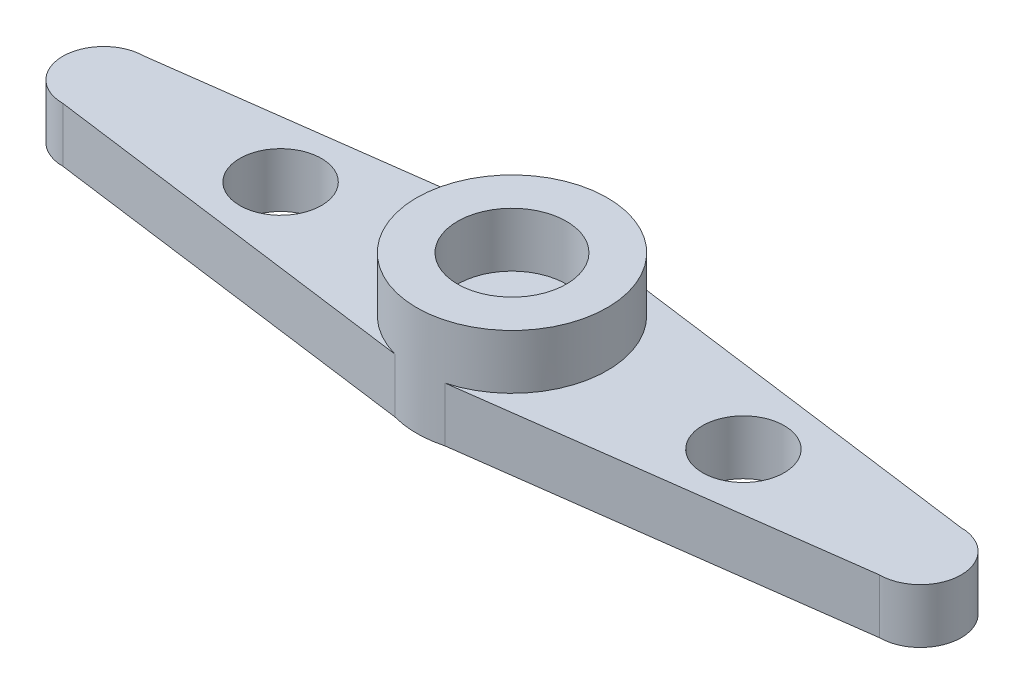
ISO-10303-21;
HEADER;
FILE_DESCRIPTION(('STEP AP214'),'2;1');
FILE_NAME('part.step','',(''),(''),'','','');
FILE_SCHEMA(('AUTOMOTIVE_DESIGN { 1 0 10303 214 1 1 1 1 }'));
ENDSEC;
DATA;
#1=APPLICATION_CONTEXT('core data for automotive mechanical design processes');
#2=APPLICATION_PROTOCOL_DEFINITION('international standard','automotive_design',2000,#1);
#3=PRODUCT_CONTEXT('',#1,'mechanical');
#4=PRODUCT('Part','Part','',(#3));
#5=PRODUCT_RELATED_PRODUCT_CATEGORY('part','',(#4));
#6=PRODUCT_DEFINITION_FORMATION('','',#4);
#7=PRODUCT_DEFINITION_CONTEXT('part definition',#1,'design');
#8=PRODUCT_DEFINITION('design','',#6,#7);
#9=PRODUCT_DEFINITION_SHAPE('','',#8);
#10=(LENGTH_UNIT() NAMED_UNIT(*) SI_UNIT(.MILLI.,.METRE.));
#11=(NAMED_UNIT(*) PLANE_ANGLE_UNIT() SI_UNIT($,.RADIAN.));
#12=(NAMED_UNIT(*) SI_UNIT($,.STERADIAN.) SOLID_ANGLE_UNIT());
#13=UNCERTAINTY_MEASURE_WITH_UNIT(LENGTH_MEASURE(1.E-05),#10,'distance_accuracy_value','');
#14=(GEOMETRIC_REPRESENTATION_CONTEXT(3) GLOBAL_UNCERTAINTY_ASSIGNED_CONTEXT((#13)) GLOBAL_UNIT_ASSIGNED_CONTEXT((#10,
#11,#12)) REPRESENTATION_CONTEXT('',''));
#15=CARTESIAN_POINT('',(0.,0.,0.));
#16=DIRECTION('',(0.,0.,1.));
#17=DIRECTION('',(1.,0.,0.));
#18=AXIS2_PLACEMENT_3D('',#15,#16,#17);
#19=CARTESIAN_POINT('',(0.,4.,0.));
#20=DIRECTION('',(0.,-1.,0.));
#21=DIRECTION('',(0.,0.,-1.));
#22=AXIS2_PLACEMENT_3D('',#19,#20,#21);
#23=CYLINDRICAL_SURFACE('',#22,3.5);
#24=CARTESIAN_POINT('',(0.,0.,0.));
#25=DIRECTION('',(0.,1.,0.));
#26=DIRECTION('',(0.,0.,1.));
#27=AXIS2_PLACEMENT_3D('',#24,#25,#26);
#28=CIRCLE('',#27,3.5);
#29=CARTESIAN_POINT('',(0.917030567685587,0.,-3.37772925764192));
#30=VERTEX_POINT('',#29);
#31=CARTESIAN_POINT('',(-0.917030567685587,0.,-3.37772925764192));
#32=VERTEX_POINT('',#31);
#33=EDGE_CURVE('E169',#30,#32,#28,.T.);
#34=ORIENTED_EDGE('',*,*,#33,.T.);
#35=DIRECTION('',(0.,-1.,0.));
#36=VECTOR('',#35,1.);
#37=CARTESIAN_POINT('',(-0.917030567685585,4.,-3.37772925764192));
#38=LINE('',#37,#36);
#39=CARTESIAN_POINT('',(-0.917030567685598,2.,-3.37772925764192));
#40=VERTEX_POINT('',#39);
#41=EDGE_CURVE('E46',#32,#40,#38,.F.);
#42=ORIENTED_EDGE('',*,*,#41,.T.);
#43=CARTESIAN_POINT('',(0.,2.,0.));
#44=DIRECTION('',(0.,-1.,0.));
#45=DIRECTION('',(0.,0.,-1.));
#46=AXIS2_PLACEMENT_3D('',#43,#44,#45);
#47=CIRCLE('',#46,3.5);
#48=CARTESIAN_POINT('',(-0.917030567685594,2.,3.37772925764192));
#49=VERTEX_POINT('',#48);
#50=EDGE_CURVE('E11',#49,#40,#47,.T.);
#51=ORIENTED_EDGE('',*,*,#50,.F.);
#52=DIRECTION('',(0.,-1.,0.));
#53=VECTOR('',#52,1.);
#54=CARTESIAN_POINT('',(-0.917030567685585,4.,3.37772925764192));
#55=LINE('',#54,#53);
#56=CARTESIAN_POINT('',(-0.917030567685587,0.,3.37772925764192));
#57=VERTEX_POINT('',#56);
#58=EDGE_CURVE('E111',#49,#57,#55,.T.);
#59=ORIENTED_EDGE('',*,*,#58,.T.);
#60=CARTESIAN_POINT('',(0.917030567685585,0.,3.37772925764192));
#61=VERTEX_POINT('',#60);
#62=EDGE_CURVE('E163',#57,#61,#28,.T.);
#63=ORIENTED_EDGE('',*,*,#62,.T.);
#64=DIRECTION('',(0.,-1.,0.));
#65=VECTOR('',#64,1.);
#66=CARTESIAN_POINT('',(0.917030567685585,4.,3.37772925764192));
#67=LINE('',#66,#65);
#68=CARTESIAN_POINT('',(0.917030567685594,2.,3.37772925764192));
#69=VERTEX_POINT('',#68);
#70=EDGE_CURVE('E156',#69,#61,#67,.T.);
#71=ORIENTED_EDGE('',*,*,#70,.F.);
#72=CARTESIAN_POINT('',(0.,2.,0.));
#73=DIRECTION('',(0.,-1.,0.));
#74=DIRECTION('',(0.,0.,-1.));
#75=AXIS2_PLACEMENT_3D('',#72,#73,#74);
#76=CIRCLE('',#75,3.5);
#77=CARTESIAN_POINT('',(0.917030567685598,2.,-3.37772925764192));
#78=VERTEX_POINT('',#77);
#79=EDGE_CURVE('E39',#78,#69,#76,.T.);
#80=ORIENTED_EDGE('',*,*,#79,.F.);
#81=DIRECTION('',(0.,-1.,0.));
#82=VECTOR('',#81,1.);
#83=CARTESIAN_POINT('',(0.917030567685585,4.,-3.37772925764192));
#84=LINE('',#83,#82);
#85=EDGE_CURVE('E153',#30,#78,#84,.F.);
#86=ORIENTED_EDGE('',*,*,#85,.F.);
#87=EDGE_LOOP('',(#34,#42,#51,#59,#63,#71,#80,#86));
#88=FACE_BOUND('',#87,.T.);
#89=CARTESIAN_POINT('',(0.,4.,0.));
#90=DIRECTION('',(0.,1.,0.));
#91=DIRECTION('',(0.,0.,1.));
#92=AXIS2_PLACEMENT_3D('',#89,#90,#91);
#93=CIRCLE('',#92,3.5);
#94=CARTESIAN_POINT('',(0.,4.,3.5));
#95=VERTEX_POINT('',#94);
#96=EDGE_CURVE('E166',#95,#95,#93,.T.);
#97=ORIENTED_EDGE('',*,*,#96,.F.);
#98=EDGE_LOOP('',(#97));
#99=FACE_BOUND('',#98,.T.);
#100=ADVANCED_FACE('F32',(#88,#99),#23,.T.);
#101=CARTESIAN_POINT('',(0.,4.,0.));
#102=DIRECTION('',(0.,1.,0.));
#103=DIRECTION('',(0.,0.,1.));
#104=AXIS2_PLACEMENT_3D('',#101,#102,#103);
#105=PLANE('',#104);
#106=CARTESIAN_POINT('',(0.,4.,0.));
#107=DIRECTION('',(0.,1.,0.));
#108=DIRECTION('',(0.,0.,1.));
#109=AXIS2_PLACEMENT_3D('',#106,#107,#108);
#110=CIRCLE('',#109,2.);
#111=CARTESIAN_POINT('',(0.,4.,2.));
#112=VERTEX_POINT('',#111);
#113=EDGE_CURVE('E159',#112,#112,#110,.T.);
#114=ORIENTED_EDGE('',*,*,#113,.F.);
#115=EDGE_LOOP('',(#114));
#116=FACE_BOUND('',#115,.T.);
#117=ORIENTED_EDGE('',*,*,#96,.T.);
#118=EDGE_LOOP('',(#117));
#119=FACE_BOUND('',#118,.T.);
#120=ADVANCED_FACE('F204',(#116,#119),#105,.T.);
#121=CARTESIAN_POINT('',(0.,0.,0.));
#122=DIRECTION('',(0.,1.,0.));
#123=DIRECTION('',(0.,0.,1.));
#124=AXIS2_PLACEMENT_3D('',#121,#122,#123);
#125=PLANE('',#124);
#126=CARTESIAN_POINT('',(8.5,0.,0.));
#127=DIRECTION('',(0.,1.,0.));
#128=DIRECTION('',(0.,0.,1.));
#129=AXIS2_PLACEMENT_3D('',#126,#127,#128);
#130=CIRCLE('',#129,1.5);
#131=CARTESIAN_POINT('',(8.5,0.,1.5));
#132=VERTEX_POINT('',#131);
#133=EDGE_CURVE('E252',#132,#132,#130,.T.);
#134=ORIENTED_EDGE('',*,*,#133,.T.);
#135=EDGE_LOOP('',(#134));
#136=FACE_BOUND('',#135,.T.);
#137=CARTESIAN_POINT('',(-8.5,0.,0.));
#138=DIRECTION('',(0.,1.,0.));
#139=DIRECTION('',(0.,0.,1.));
#140=AXIS2_PLACEMENT_3D('',#137,#138,#139);
#141=CIRCLE('',#140,1.5);
#142=CARTESIAN_POINT('',(-8.5,0.,1.5));
#143=VERTEX_POINT('',#142);
#144=EDGE_CURVE('E118',#143,#143,#141,.T.);
#145=ORIENTED_EDGE('',*,*,#144,.T.);
#146=EDGE_LOOP('',(#145));
#147=FACE_BOUND('',#146,.T.);
#148=CARTESIAN_POINT('',(-15.,0.,0.));
#149=DIRECTION('',(0.,-1.,0.));
#150=DIRECTION('',(0.,0.,1.));
#151=AXIS2_PLACEMENT_3D('',#148,#149,#150);
#152=CIRCLE('',#151,1.5);
#153=CARTESIAN_POINT('',(-15.,0.,1.5));
#154=VERTEX_POINT('',#153);
#155=CARTESIAN_POINT('',(-15.,0.,-1.5));
#156=VERTEX_POINT('',#155);
#157=EDGE_CURVE('E117',#154,#156,#152,.T.);
#158=ORIENTED_EDGE('',*,*,#157,.T.);
#159=DIRECTION('',(0.991227900682635,0.,-0.132163720091018));
#160=VECTOR('',#159,1.);
#161=CARTESIAN_POINT('',(0.,0.,-3.5));
#162=LINE('',#161,#160);
#163=EDGE_CURVE('E107',#156,#32,#162,.T.);
#164=ORIENTED_EDGE('',*,*,#163,.T.);
#165=ORIENTED_EDGE('',*,*,#33,.F.);
#166=DIRECTION('',(-0.991227900682635,0.,-0.132163720091018));
#167=VECTOR('',#166,1.);
#168=CARTESIAN_POINT('',(0.,0.,-3.5));
#169=LINE('',#168,#167);
#170=CARTESIAN_POINT('',(15.,0.,-1.5));
#171=VERTEX_POINT('',#170);
#172=EDGE_CURVE('E141',#171,#30,#169,.T.);
#173=ORIENTED_EDGE('',*,*,#172,.F.);
#174=CARTESIAN_POINT('',(15.,0.,0.));
#175=DIRECTION('',(0.,1.,0.));
#176=DIRECTION('',(0.,0.,1.));
#177=AXIS2_PLACEMENT_3D('',#174,#175,#176);
#178=CIRCLE('',#177,1.5);
#179=CARTESIAN_POINT('',(15.,0.,1.5));
#180=VERTEX_POINT('',#179);
#181=EDGE_CURVE('E133',#180,#171,#178,.T.);
#182=ORIENTED_EDGE('',*,*,#181,.F.);
#183=DIRECTION('',(0.991227900682635,0.,-0.132163720091018));
#184=VECTOR('',#183,1.);
#185=CARTESIAN_POINT('',(15.,0.,1.5));
#186=LINE('',#185,#184);
#187=EDGE_CURVE('E135',#61,#180,#186,.T.);
#188=ORIENTED_EDGE('',*,*,#187,.F.);
#189=ORIENTED_EDGE('',*,*,#62,.F.);
#190=DIRECTION('',(-0.991227900682635,0.,-0.132163720091018));
#191=VECTOR('',#190,1.);
#192=CARTESIAN_POINT('',(-15.,0.,1.5));
#193=LINE('',#192,#191);
#194=EDGE_CURVE('E101',#57,#154,#193,.T.);
#195=ORIENTED_EDGE('',*,*,#194,.T.);
#196=EDGE_LOOP('',(#158,#164,#165,#173,#182,#188,#189,#195));
#197=FACE_BOUND('',#196,.T.);
#198=ADVANCED_FACE('F186',(#136,#147,#197),#125,.F.);
#199=CARTESIAN_POINT('',(0.,2.,0.));
#200=DIRECTION('',(0.,1.,0.));
#201=DIRECTION('',(0.,0.,1.));
#202=AXIS2_PLACEMENT_3D('',#199,#200,#201);
#203=CYLINDRICAL_SURFACE('',#202,2.);
#204=CARTESIAN_POINT('',(0.,2.,0.));
#205=DIRECTION('',(0.,1.,0.));
#206=DIRECTION('',(0.,0.,1.));
#207=AXIS2_PLACEMENT_3D('',#204,#205,#206);
#208=CIRCLE('',#207,2.);
#209=CARTESIAN_POINT('',(0.,2.,2.));
#210=VERTEX_POINT('',#209);
#211=EDGE_CURVE('E160',#210,#210,#208,.T.);
#212=ORIENTED_EDGE('',*,*,#211,.F.);
#213=EDGE_LOOP('',(#212));
#214=FACE_BOUND('',#213,.T.);
#215=ORIENTED_EDGE('',*,*,#113,.T.);
#216=EDGE_LOOP('',(#215));
#217=FACE_BOUND('',#216,.T.);
#218=ADVANCED_FACE('F213',(#214,#217),#203,.F.);
#219=CARTESIAN_POINT('',(0.,2.,0.));
#220=DIRECTION('',(0.,1.,0.));
#221=DIRECTION('',(0.,0.,1.));
#222=AXIS2_PLACEMENT_3D('',#219,#220,#221);
#223=PLANE('',#222);
#224=ORIENTED_EDGE('',*,*,#211,.T.);
#225=EDGE_LOOP('',(#224));
#226=FACE_BOUND('',#225,.T.);
#227=ADVANCED_FACE('F220',(#226),#223,.T.);
#228=CARTESIAN_POINT('',(0.,2.,0.));
#229=DIRECTION('',(0.,-1.,0.));
#230=DIRECTION('',(0.,0.,-1.));
#231=AXIS2_PLACEMENT_3D('',#228,#229,#230);
#232=PLANE('',#231);
#233=CARTESIAN_POINT('',(8.5,2.,0.));
#234=DIRECTION('',(0.,1.,0.));
#235=DIRECTION('',(0.,0.,1.));
#236=AXIS2_PLACEMENT_3D('',#233,#234,#235);
#237=CIRCLE('',#236,1.5);
#238=CARTESIAN_POINT('',(8.5,2.,1.5));
#239=VERTEX_POINT('',#238);
#240=EDGE_CURVE('E255',#239,#239,#237,.T.);
#241=ORIENTED_EDGE('',*,*,#240,.F.);
#242=EDGE_LOOP('',(#241));
#243=FACE_BOUND('',#242,.T.);
#244=DIRECTION('',(0.991227900682635,0.,-0.132163720091018));
#245=VECTOR('',#244,1.);
#246=CARTESIAN_POINT('',(15.,2.,1.5));
#247=LINE('',#246,#245);
#248=CARTESIAN_POINT('',(15.,2.,1.5));
#249=VERTEX_POINT('',#248);
#250=EDGE_CURVE('E137',#69,#249,#247,.T.);
#251=ORIENTED_EDGE('',*,*,#250,.T.);
#252=CARTESIAN_POINT('',(15.,2.,0.));
#253=DIRECTION('',(0.,1.,0.));
#254=DIRECTION('',(0.,0.,1.));
#255=AXIS2_PLACEMENT_3D('',#252,#253,#254);
#256=CIRCLE('',#255,1.5);
#257=CARTESIAN_POINT('',(15.,2.,-1.5));
#258=VERTEX_POINT('',#257);
#259=EDGE_CURVE('E132',#249,#258,#256,.T.);
#260=ORIENTED_EDGE('',*,*,#259,.T.);
#261=DIRECTION('',(-0.991227900682635,0.,-0.132163720091018));
#262=VECTOR('',#261,1.);
#263=CARTESIAN_POINT('',(0.,2.,-3.5));
#264=LINE('',#263,#262);
#265=EDGE_CURVE('E140',#258,#78,#264,.T.);
#266=ORIENTED_EDGE('',*,*,#265,.T.);
#267=ORIENTED_EDGE('',*,*,#79,.T.);
#268=EDGE_LOOP('',(#251,#260,#266,#267));
#269=FACE_BOUND('',#268,.T.);
#270=ADVANCED_FACE('F173',(#243,#269),#232,.F.);
#271=CARTESIAN_POINT('',(15.,2.,1.5));
#272=DIRECTION('',(-0.132163720091018,0.,-0.991227900682635));
#273=DIRECTION('',(-0.991227900682635,0.,0.132163720091018));
#274=AXIS2_PLACEMENT_3D('',#271,#272,#273);
#275=PLANE('',#274);
#276=ORIENTED_EDGE('',*,*,#250,.F.);
#277=ORIENTED_EDGE('',*,*,#70,.T.);
#278=ORIENTED_EDGE('',*,*,#187,.T.);
#279=DIRECTION('',(0.,-1.,0.));
#280=VECTOR('',#279,1.);
#281=CARTESIAN_POINT('',(15.,2.,1.5));
#282=LINE('',#281,#280);
#283=EDGE_CURVE('E151',#249,#180,#282,.T.);
#284=ORIENTED_EDGE('',*,*,#283,.F.);
#285=EDGE_LOOP('',(#276,#277,#278,#284));
#286=FACE_BOUND('',#285,.T.);
#287=ADVANCED_FACE('F178',(#286),#275,.F.);
#288=CARTESIAN_POINT('',(0.,2.,-3.5));
#289=DIRECTION('',(-0.132163720091018,0.,0.991227900682635));
#290=DIRECTION('',(0.991227900682635,0.,0.132163720091018));
#291=AXIS2_PLACEMENT_3D('',#288,#289,#290);
#292=PLANE('',#291);
#293=ORIENTED_EDGE('',*,*,#172,.T.);
#294=ORIENTED_EDGE('',*,*,#85,.T.);
#295=ORIENTED_EDGE('',*,*,#265,.F.);
#296=DIRECTION('',(0.,-1.,0.));
#297=VECTOR('',#296,1.);
#298=CARTESIAN_POINT('',(15.,2.,-1.5));
#299=LINE('',#298,#297);
#300=EDGE_CURVE('E144',#258,#171,#299,.T.);
#301=ORIENTED_EDGE('',*,*,#300,.T.);
#302=EDGE_LOOP('',(#293,#294,#295,#301));
#303=FACE_BOUND('',#302,.T.);
#304=ADVANCED_FACE('F188',(#303),#292,.F.);
#305=CARTESIAN_POINT('',(15.,0.,0.));
#306=DIRECTION('',(0.,1.,0.));
#307=DIRECTION('',(0.,0.,1.));
#308=AXIS2_PLACEMENT_3D('',#305,#306,#307);
#309=CYLINDRICAL_SURFACE('',#308,1.5);
#310=ORIENTED_EDGE('',*,*,#283,.T.);
#311=ORIENTED_EDGE('',*,*,#181,.T.);
#312=ORIENTED_EDGE('',*,*,#300,.F.);
#313=ORIENTED_EDGE('',*,*,#259,.F.);
#314=EDGE_LOOP('',(#310,#311,#312,#313));
#315=FACE_BOUND('',#314,.T.);
#316=ADVANCED_FACE('F182',(#315),#309,.T.);
#317=CARTESIAN_POINT('',(0.,2.,0.));
#318=DIRECTION('',(0.,-1.,0.));
#319=DIRECTION('',(0.,0.,-1.));
#320=AXIS2_PLACEMENT_3D('',#317,#318,#319);
#321=PLANE('',#320);
#322=CARTESIAN_POINT('',(-8.5,2.,0.));
#323=DIRECTION('',(0.,1.,0.));
#324=DIRECTION('',(0.,0.,1.));
#325=AXIS2_PLACEMENT_3D('',#322,#323,#324);
#326=CIRCLE('',#325,1.5);
#327=CARTESIAN_POINT('',(-8.5,2.,1.5));
#328=VERTEX_POINT('',#327);
#329=EDGE_CURVE('E122',#328,#328,#326,.T.);
#330=ORIENTED_EDGE('',*,*,#329,.F.);
#331=EDGE_LOOP('',(#330));
#332=FACE_BOUND('',#331,.T.);
#333=CARTESIAN_POINT('',(-15.,2.,0.));
#334=DIRECTION('',(0.,-1.,0.));
#335=DIRECTION('',(0.,0.,1.));
#336=AXIS2_PLACEMENT_3D('',#333,#334,#335);
#337=CIRCLE('',#336,1.5);
#338=CARTESIAN_POINT('',(-15.,2.,1.5));
#339=VERTEX_POINT('',#338);
#340=CARTESIAN_POINT('',(-15.,2.,-1.5));
#341=VERTEX_POINT('',#340);
#342=EDGE_CURVE('E98',#339,#341,#337,.T.);
#343=ORIENTED_EDGE('',*,*,#342,.F.);
#344=DIRECTION('',(-0.991227900682635,0.,-0.132163720091018));
#345=VECTOR('',#344,1.);
#346=CARTESIAN_POINT('',(-15.,2.,1.5));
#347=LINE('',#346,#345);
#348=EDGE_CURVE('E100',#49,#339,#347,.T.);
#349=ORIENTED_EDGE('',*,*,#348,.F.);
#350=ORIENTED_EDGE('',*,*,#50,.T.);
#351=DIRECTION('',(0.991227900682635,0.,-0.132163720091018));
#352=VECTOR('',#351,1.);
#353=CARTESIAN_POINT('',(0.,2.,-3.5));
#354=LINE('',#353,#352);
#355=EDGE_CURVE('E93',#341,#40,#354,.T.);
#356=ORIENTED_EDGE('',*,*,#355,.F.);
#357=EDGE_LOOP('',(#343,#349,#350,#356));
#358=FACE_BOUND('',#357,.T.);
#359=ADVANCED_FACE('F95',(#332,#358),#321,.F.);
#360=CARTESIAN_POINT('',(0.,2.,-3.5));
#361=DIRECTION('',(-0.132163720091018,0.,-0.991227900682635));
#362=DIRECTION('',(-0.991227900682635,0.,0.132163720091018));
#363=AXIS2_PLACEMENT_3D('',#360,#361,#362);
#364=PLANE('',#363);
#365=ORIENTED_EDGE('',*,*,#41,.F.);
#366=ORIENTED_EDGE('',*,*,#163,.F.);
#367=DIRECTION('',(0.,-1.,0.));
#368=VECTOR('',#367,1.);
#369=CARTESIAN_POINT('',(-15.,2.,-1.5));
#370=LINE('',#369,#368);
#371=EDGE_CURVE('E104',#341,#156,#370,.T.);
#372=ORIENTED_EDGE('',*,*,#371,.F.);
#373=ORIENTED_EDGE('',*,*,#355,.T.);
#374=EDGE_LOOP('',(#365,#366,#372,#373));
#375=FACE_BOUND('',#374,.T.);
#376=ADVANCED_FACE('F105',(#375),#364,.T.);
#377=CARTESIAN_POINT('',(-15.,2.,1.5));
#378=DIRECTION('',(-0.132163720091018,0.,0.991227900682635));
#379=DIRECTION('',(0.991227900682635,0.,0.132163720091018));
#380=AXIS2_PLACEMENT_3D('',#377,#378,#379);
#381=PLANE('',#380);
#382=ORIENTED_EDGE('',*,*,#58,.F.);
#383=ORIENTED_EDGE('',*,*,#348,.T.);
#384=DIRECTION('',(0.,-1.,0.));
#385=VECTOR('',#384,1.);
#386=CARTESIAN_POINT('',(-15.,2.,1.5));
#387=LINE('',#386,#385);
#388=EDGE_CURVE('E112',#339,#154,#387,.T.);
#389=ORIENTED_EDGE('',*,*,#388,.T.);
#390=ORIENTED_EDGE('',*,*,#194,.F.);
#391=EDGE_LOOP('',(#382,#383,#389,#390));
#392=FACE_BOUND('',#391,.T.);
#393=ADVANCED_FACE('F192',(#392),#381,.T.);
#394=CARTESIAN_POINT('',(-15.,0.,0.));
#395=DIRECTION('',(0.,1.,0.));
#396=DIRECTION('',(0.,0.,1.));
#397=AXIS2_PLACEMENT_3D('',#394,#395,#396);
#398=CYLINDRICAL_SURFACE('',#397,1.5);
#399=ORIENTED_EDGE('',*,*,#388,.F.);
#400=ORIENTED_EDGE('',*,*,#342,.T.);
#401=ORIENTED_EDGE('',*,*,#371,.T.);
#402=ORIENTED_EDGE('',*,*,#157,.F.);
#403=EDGE_LOOP('',(#399,#400,#401,#402));
#404=FACE_BOUND('',#403,.T.);
#405=ADVANCED_FACE('F115',(#404),#398,.T.);
#406=CARTESIAN_POINT('',(-8.5,0.,0.));
#407=DIRECTION('',(0.,1.,0.));
#408=DIRECTION('',(0.,0.,1.));
#409=AXIS2_PLACEMENT_3D('',#406,#407,#408);
#410=CYLINDRICAL_SURFACE('',#409,1.5);
#411=ORIENTED_EDGE('',*,*,#144,.F.);
#412=EDGE_LOOP('',(#411));
#413=FACE_BOUND('',#412,.T.);
#414=ORIENTED_EDGE('',*,*,#329,.T.);
#415=EDGE_LOOP('',(#414));
#416=FACE_BOUND('',#415,.T.);
#417=ADVANCED_FACE('F199',(#413,#416),#410,.F.);
#418=CARTESIAN_POINT('',(8.5,0.,0.));
#419=DIRECTION('',(0.,1.,0.));
#420=DIRECTION('',(0.,0.,1.));
#421=AXIS2_PLACEMENT_3D('',#418,#419,#420);
#422=CYLINDRICAL_SURFACE('',#421,1.5);
#423=ORIENTED_EDGE('',*,*,#133,.F.);
#424=EDGE_LOOP('',(#423));
#425=FACE_BOUND('',#424,.T.);
#426=ORIENTED_EDGE('',*,*,#240,.T.);
#427=EDGE_LOOP('',(#426));
#428=FACE_BOUND('',#427,.T.);
#429=ADVANCED_FACE('F243',(#425,#428),#422,.F.);
#430=CLOSED_SHELL('',(#100,#120,#198,#218,#227,#270,#287,#304,#316,#359,#376,#393,#405,#417,#429));
#431=MANIFOLD_SOLID_BREP('B2',#430);
#432=ADVANCED_BREP_SHAPE_REPRESENTATION('',(#18,#431),#14);
#433=SHAPE_DEFINITION_REPRESENTATION(#9,#432);
ENDSEC;
END-ISO-10303-21;
